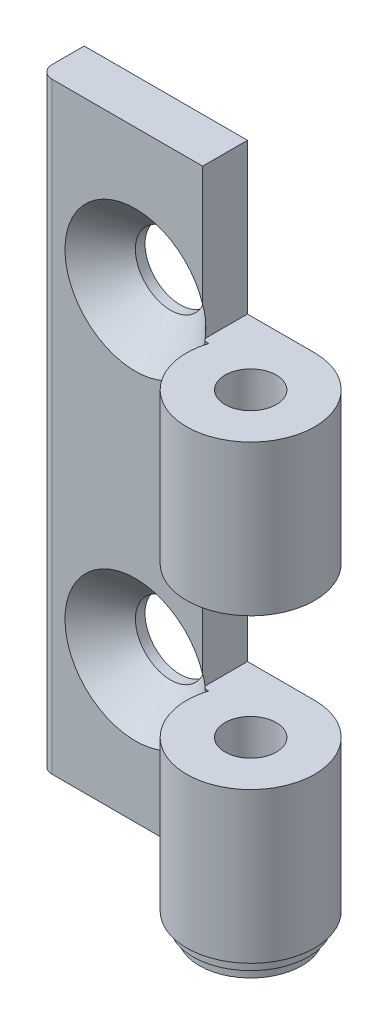
ISO-10303-21;
HEADER;
FILE_DESCRIPTION(('STEP AP214'),'2;1');
FILE_NAME('part.step','',(''),(''),'','','');
FILE_SCHEMA(('AUTOMOTIVE_DESIGN { 1 0 10303 214 1 1 1 1 }'));
ENDSEC;
DATA;
#1=APPLICATION_CONTEXT('core data for automotive mechanical design processes');
#2=APPLICATION_PROTOCOL_DEFINITION('international standard','automotive_design',2000,#1);
#3=PRODUCT_CONTEXT('',#1,'mechanical');
#4=PRODUCT('Part','Part','',(#3));
#5=PRODUCT_RELATED_PRODUCT_CATEGORY('part','',(#4));
#6=PRODUCT_DEFINITION_FORMATION('','',#4);
#7=PRODUCT_DEFINITION_CONTEXT('part definition',#1,'design');
#8=PRODUCT_DEFINITION('design','',#6,#7);
#9=PRODUCT_DEFINITION_SHAPE('','',#8);
#10=(LENGTH_UNIT() NAMED_UNIT(*) SI_UNIT(.MILLI.,.METRE.));
#11=(NAMED_UNIT(*) PLANE_ANGLE_UNIT() SI_UNIT($,.RADIAN.));
#12=(NAMED_UNIT(*) SI_UNIT($,.STERADIAN.) SOLID_ANGLE_UNIT());
#13=UNCERTAINTY_MEASURE_WITH_UNIT(LENGTH_MEASURE(1.E-05),#10,'distance_accuracy_value','');
#14=(GEOMETRIC_REPRESENTATION_CONTEXT(3) GLOBAL_UNCERTAINTY_ASSIGNED_CONTEXT((#13)) GLOBAL_UNIT_ASSIGNED_CONTEXT((#10,
#11,#12)) REPRESENTATION_CONTEXT('',''));
#15=CARTESIAN_POINT('',(0.,0.,0.));
#16=DIRECTION('',(0.,0.,1.));
#17=DIRECTION('',(1.,0.,0.));
#18=AXIS2_PLACEMENT_3D('',#15,#16,#17);
#19=CARTESIAN_POINT('',(0.,0.,-1.5));
#20=DIRECTION('',(0.,0.,1.));
#21=DIRECTION('',(1.,0.,0.));
#22=AXIS2_PLACEMENT_3D('',#19,#20,#21);
#23=PLANE('',#22);
#24=DIRECTION('',(-1.,0.,0.));
#25=VECTOR('',#24,1.);
#26=CARTESIAN_POINT('',(0.,23.5,-1.5));
#27=LINE('',#26,#25);
#28=CARTESIAN_POINT('',(-5.25,23.5,-1.5));
#29=VERTEX_POINT('',#28);
#30=CARTESIAN_POINT('',(-17.,23.5,-1.5));
#31=VERTEX_POINT('',#30);
#32=EDGE_CURVE('E156',#29,#31,#27,.T.);
#33=ORIENTED_EDGE('',*,*,#32,.T.);
#34=DIRECTION('',(0.,-1.,0.));
#35=VECTOR('',#34,1.);
#36=CARTESIAN_POINT('',(-17.,23.5,-1.5));
#37=LINE('',#36,#35);
#38=CARTESIAN_POINT('',(-17.,-23.5,-1.5));
#39=VERTEX_POINT('',#38);
#40=EDGE_CURVE('E137',#31,#39,#37,.T.);
#41=ORIENTED_EDGE('',*,*,#40,.T.);
#42=DIRECTION('',(1.,0.,0.));
#43=VECTOR('',#42,1.);
#44=CARTESIAN_POINT('',(-18.,-23.5,-1.5));
#45=LINE('',#44,#43);
#46=CARTESIAN_POINT('',(-4.76969600708473,-23.5,-1.5));
#47=VERTEX_POINT('',#46);
#48=EDGE_CURVE('E146',#39,#47,#45,.T.);
#49=ORIENTED_EDGE('',*,*,#48,.T.);
#50=DIRECTION('',(0.,1.,0.));
#51=VECTOR('',#50,1.);
#52=CARTESIAN_POINT('',(-4.76969600708473,-23.5,-1.5));
#53=LINE('',#52,#51);
#54=CARTESIAN_POINT('',(-4.76969600708473,-11.75,-1.5));
#55=VERTEX_POINT('',#54);
#56=EDGE_CURVE('E154',#55,#47,#53,.F.);
#57=ORIENTED_EDGE('',*,*,#56,.F.);
#58=DIRECTION('',(1.,0.,0.));
#59=VECTOR('',#58,1.);
#60=CARTESIAN_POINT('',(0.,-11.75,-1.5));
#61=LINE('',#60,#59);
#62=CARTESIAN_POINT('',(-5.05137632057416,-11.75,-1.5));
#63=VERTEX_POINT('',#62);
#64=EDGE_CURVE('E277',#63,#55,#61,.T.);
#65=ORIENTED_EDGE('',*,*,#64,.F.);
#66=CARTESIAN_POINT('',(-10.5,-12.5,-1.5));
#67=DIRECTION('',(0.,0.,-1.));
#68=DIRECTION('',(-1.,0.,0.));
#69=AXIS2_PLACEMENT_3D('',#66,#67,#68);
#70=CIRCLE('',#69,5.5);
#71=CARTESIAN_POINT('',(-5.25,-10.8606403689245,-1.5));
#72=VERTEX_POINT('',#71);
#73=EDGE_CURVE('E298',#63,#72,#70,.T.);
#74=ORIENTED_EDGE('',*,*,#73,.T.);
#75=DIRECTION('',(0.,-1.,0.));
#76=VECTOR('',#75,1.);
#77=CARTESIAN_POINT('',(-5.25,0.,-1.5));
#78=LINE('',#77,#76);
#79=CARTESIAN_POINT('',(-5.25,0.,-1.5));
#80=VERTEX_POINT('',#79);
#81=EDGE_CURVE('E266',#80,#72,#78,.T.);
#82=ORIENTED_EDGE('',*,*,#81,.F.);
#83=DIRECTION('',(-1.,0.,0.));
#84=VECTOR('',#83,1.);
#85=CARTESIAN_POINT('',(0.,0.,-1.5));
#86=LINE('',#85,#84);
#87=CARTESIAN_POINT('',(-4.76969600708473,0.,-1.5));
#88=VERTEX_POINT('',#87);
#89=EDGE_CURVE('E263',#88,#80,#86,.T.);
#90=ORIENTED_EDGE('',*,*,#89,.F.);
#91=CARTESIAN_POINT('',(-4.76969600708473,11.75,-1.5));
#92=VERTEX_POINT('',#91);
#93=EDGE_CURVE('E164',#92,#88,#53,.F.);
#94=ORIENTED_EDGE('',*,*,#93,.F.);
#95=DIRECTION('',(1.,0.,0.));
#96=VECTOR('',#95,1.);
#97=CARTESIAN_POINT('',(0.,11.75,-1.5));
#98=LINE('',#97,#96);
#99=CARTESIAN_POINT('',(-5.05137632057416,11.75,-1.5));
#100=VERTEX_POINT('',#99);
#101=EDGE_CURVE('E261',#100,#92,#98,.T.);
#102=ORIENTED_EDGE('',*,*,#101,.F.);
#103=CARTESIAN_POINT('',(-10.5,12.5,-1.5));
#104=DIRECTION('',(0.,0.,-1.));
#105=DIRECTION('',(-1.,0.,0.));
#106=AXIS2_PLACEMENT_3D('',#103,#104,#105);
#107=CIRCLE('',#106,5.5);
#108=CARTESIAN_POINT('',(-5.25,14.1393596310755,-1.5));
#109=VERTEX_POINT('',#108);
#110=EDGE_CURVE('E136',#100,#109,#107,.T.);
#111=ORIENTED_EDGE('',*,*,#110,.T.);
#112=DIRECTION('',(0.,-1.,0.));
#113=VECTOR('',#112,1.);
#114=CARTESIAN_POINT('',(-5.25,0.,-1.5));
#115=LINE('',#114,#113);
#116=EDGE_CURVE('E508',#29,#109,#115,.T.);
#117=ORIENTED_EDGE('',*,*,#116,.F.);
#118=EDGE_LOOP('',(#33,#41,#49,#57,#65,#74,#82,#90,#94,#102,#111,#117));
#119=FACE_BOUND('',#118,.T.);
#120=ADVANCED_FACE('F32',(#119),#23,.T.);
#121=CARTESIAN_POINT('',(5.,-23.5,0.));
#122=DIRECTION('',(0.,1.,0.));
#123=DIRECTION('',(0.,0.,1.));
#124=AXIS2_PLACEMENT_3D('',#121,#122,#123);
#125=PLANE('',#124);
#126=CARTESIAN_POINT('',(0.,-23.5,0.));
#127=DIRECTION('',(0.,1.,0.));
#128=DIRECTION('',(0.,0.,1.));
#129=AXIS2_PLACEMENT_3D('',#126,#127,#128);
#130=CIRCLE('',#129,4.5);
#131=CARTESIAN_POINT('',(0.,-23.5,4.5));
#132=VERTEX_POINT('',#131);
#133=EDGE_CURVE('E182',#132,#132,#130,.F.);
#134=ORIENTED_EDGE('',*,*,#133,.F.);
#135=EDGE_LOOP('',(#134));
#136=FACE_BOUND('',#135,.T.);
#137=CARTESIAN_POINT('',(-17.0000000000007,-23.5,-2.49999999999931));
#138=DIRECTION('',(0.,-1.,0.));
#139=DIRECTION('',(0.,0.,-1.));
#140=AXIS2_PLACEMENT_3D('',#137,#138,#139);
#141=CIRCLE('',#140,0.999999999999304);
#142=CARTESIAN_POINT('',(-18.,-23.5,-2.5));
#143=VERTEX_POINT('',#142);
#144=EDGE_CURVE('E131',#39,#143,#141,.T.);
#145=ORIENTED_EDGE('',*,*,#144,.T.);
#146=DIRECTION('',(0.,0.,-1.));
#147=VECTOR('',#146,1.);
#148=CARTESIAN_POINT('',(-18.,-23.5,-1.5));
#149=LINE('',#148,#147);
#150=CARTESIAN_POINT('',(-18.,-23.5,-5.));
#151=VERTEX_POINT('',#150);
#152=EDGE_CURVE('E143',#143,#151,#149,.T.);
#153=ORIENTED_EDGE('',*,*,#152,.T.);
#154=DIRECTION('',(1.,0.,0.));
#155=VECTOR('',#154,1.);
#156=CARTESIAN_POINT('',(-18.,-23.5,-5.));
#157=LINE('',#156,#155);
#158=CARTESIAN_POINT('',(0.,-23.5,-5.));
#159=VERTEX_POINT('',#158);
#160=EDGE_CURVE('E283',#151,#159,#157,.T.);
#161=ORIENTED_EDGE('',*,*,#160,.T.);
#162=CARTESIAN_POINT('',(0.,-23.5,0.));
#163=DIRECTION('',(0.,1.,0.));
#164=DIRECTION('',(0.,0.,1.));
#165=AXIS2_PLACEMENT_3D('',#162,#163,#164);
#166=CIRCLE('',#165,5.);
#167=EDGE_CURVE('E165',#47,#159,#166,.T.);
#168=ORIENTED_EDGE('',*,*,#167,.F.);
#169=ORIENTED_EDGE('',*,*,#48,.F.);
#170=EDGE_LOOP('',(#145,#153,#161,#168,#169));
#171=FACE_BOUND('',#170,.T.);
#172=ADVANCED_FACE('F141',(#136,#171),#125,.F.);
#173=CARTESIAN_POINT('',(0.,23.5,0.));
#174=DIRECTION('',(0.,-1.,0.));
#175=DIRECTION('',(0.,0.,-1.));
#176=AXIS2_PLACEMENT_3D('',#173,#174,#175);
#177=PLANE('',#176);
#178=CARTESIAN_POINT('',(-17.0000000000007,23.5,-2.49999999999931));
#179=DIRECTION('',(0.,-1.,0.));
#180=DIRECTION('',(0.,0.,-1.));
#181=AXIS2_PLACEMENT_3D('',#178,#179,#180);
#182=CIRCLE('',#181,0.999999999999304);
#183=CARTESIAN_POINT('',(-18.,23.5,-2.5));
#184=VERTEX_POINT('',#183);
#185=EDGE_CURVE('E52',#31,#184,#182,.T.);
#186=ORIENTED_EDGE('',*,*,#185,.F.);
#187=ORIENTED_EDGE('',*,*,#32,.F.);
#188=DIRECTION('',(0.,0.,-1.));
#189=VECTOR('',#188,1.);
#190=CARTESIAN_POINT('',(-5.25,23.5,47.));
#191=LINE('',#190,#189);
#192=CARTESIAN_POINT('',(-5.25,23.5,-5.));
#193=VERTEX_POINT('',#192);
#194=EDGE_CURVE('E500',#29,#193,#191,.T.);
#195=ORIENTED_EDGE('',*,*,#194,.T.);
#196=DIRECTION('',(-1.,0.,0.));
#197=VECTOR('',#196,1.);
#198=CARTESIAN_POINT('',(0.,23.5,-5.));
#199=LINE('',#198,#197);
#200=CARTESIAN_POINT('',(-18.,23.5,-5.));
#201=VERTEX_POINT('',#200);
#202=EDGE_CURVE('E279',#193,#201,#199,.T.);
#203=ORIENTED_EDGE('',*,*,#202,.T.);
#204=DIRECTION('',(0.,0.,-1.));
#205=VECTOR('',#204,1.);
#206=CARTESIAN_POINT('',(-18.,23.5,-1.5));
#207=LINE('',#206,#205);
#208=EDGE_CURVE('E152',#184,#201,#207,.T.);
#209=ORIENTED_EDGE('',*,*,#208,.F.);
#210=EDGE_LOOP('',(#186,#187,#195,#203,#209));
#211=FACE_BOUND('',#210,.T.);
#212=ADVANCED_FACE('F34',(#211),#177,.F.);
#213=CARTESIAN_POINT('',(-18.,23.5,-1.5));
#214=DIRECTION('',(1.,0.,0.));
#215=DIRECTION('',(0.,0.,-1.));
#216=AXIS2_PLACEMENT_3D('',#213,#214,#215);
#217=PLANE('',#216);
#218=DIRECTION('',(0.,-1.,0.));
#219=VECTOR('',#218,1.);
#220=CARTESIAN_POINT('',(-18.,23.5,-2.5));
#221=LINE('',#220,#219);
#222=EDGE_CURVE('E128',#184,#143,#221,.T.);
#223=ORIENTED_EDGE('',*,*,#222,.F.);
#224=ORIENTED_EDGE('',*,*,#208,.T.);
#225=DIRECTION('',(0.,-1.,0.));
#226=VECTOR('',#225,1.);
#227=CARTESIAN_POINT('',(-18.,23.5,-5.));
#228=LINE('',#227,#226);
#229=EDGE_CURVE('E150',#201,#151,#228,.T.);
#230=ORIENTED_EDGE('',*,*,#229,.T.);
#231=ORIENTED_EDGE('',*,*,#152,.F.);
#232=EDGE_LOOP('',(#223,#224,#230,#231));
#233=FACE_BOUND('',#232,.T.);
#234=ADVANCED_FACE('F148',(#233),#217,.F.);
#235=CARTESIAN_POINT('',(0.,0.,-5.));
#236=DIRECTION('',(0.,0.,1.));
#237=DIRECTION('',(1.,0.,0.));
#238=AXIS2_PLACEMENT_3D('',#235,#236,#237);
#239=PLANE('',#238);
#240=CARTESIAN_POINT('',(-10.5,-12.5,-5.));
#241=DIRECTION('',(0.,0.,-1.));
#242=DIRECTION('',(-1.,0.,0.));
#243=AXIS2_PLACEMENT_3D('',#240,#241,#242);
#244=CIRCLE('',#243,2.75);
#245=CARTESIAN_POINT('',(-13.25,-12.5,-5.));
#246=VERTEX_POINT('',#245);
#247=EDGE_CURVE('E215',#246,#246,#244,.T.);
#248=ORIENTED_EDGE('',*,*,#247,.F.);
#249=EDGE_LOOP('',(#248));
#250=FACE_BOUND('',#249,.T.);
#251=DIRECTION('',(0.,-1.,0.));
#252=VECTOR('',#251,1.);
#253=CARTESIAN_POINT('',(-5.25,0.,-5.));
#254=LINE('',#253,#252);
#255=CARTESIAN_POINT('',(-5.25,0.,-5.));
#256=VERTEX_POINT('',#255);
#257=CARTESIAN_POINT('',(-5.25,-11.75,-5.));
#258=VERTEX_POINT('',#257);
#259=EDGE_CURVE('E176',#256,#258,#254,.T.);
#260=ORIENTED_EDGE('',*,*,#259,.T.);
#261=DIRECTION('',(1.,0.,0.));
#262=VECTOR('',#261,1.);
#263=CARTESIAN_POINT('',(0.,-11.75,-5.));
#264=LINE('',#263,#262);
#265=CARTESIAN_POINT('',(0.,-11.75,-5.));
#266=VERTEX_POINT('',#265);
#267=EDGE_CURVE('E179',#258,#266,#264,.T.);
#268=ORIENTED_EDGE('',*,*,#267,.T.);
#269=DIRECTION('',(0.,1.,0.));
#270=VECTOR('',#269,1.);
#271=CARTESIAN_POINT('',(0.,-23.5,-5.));
#272=LINE('',#271,#270);
#273=EDGE_CURVE('E159',#159,#266,#272,.T.);
#274=ORIENTED_EDGE('',*,*,#273,.F.);
#275=ORIENTED_EDGE('',*,*,#160,.F.);
#276=ORIENTED_EDGE('',*,*,#229,.F.);
#277=ORIENTED_EDGE('',*,*,#202,.F.);
#278=DIRECTION('',(0.,-1.,0.));
#279=VECTOR('',#278,1.);
#280=CARTESIAN_POINT('',(-5.25,0.,-5.));
#281=LINE('',#280,#279);
#282=CARTESIAN_POINT('',(-5.25,11.75,-5.));
#283=VERTEX_POINT('',#282);
#284=EDGE_CURVE('E167',#193,#283,#281,.T.);
#285=ORIENTED_EDGE('',*,*,#284,.T.);
#286=DIRECTION('',(1.,0.,0.));
#287=VECTOR('',#286,1.);
#288=CARTESIAN_POINT('',(0.,11.75,-5.));
#289=LINE('',#288,#287);
#290=CARTESIAN_POINT('',(0.,11.75,-5.));
#291=VERTEX_POINT('',#290);
#292=EDGE_CURVE('E170',#283,#291,#289,.T.);
#293=ORIENTED_EDGE('',*,*,#292,.T.);
#294=CARTESIAN_POINT('',(0.,0.,-5.));
#295=VERTEX_POINT('',#294);
#296=EDGE_CURVE('E284',#295,#291,#272,.T.);
#297=ORIENTED_EDGE('',*,*,#296,.F.);
#298=DIRECTION('',(-1.,0.,0.));
#299=VECTOR('',#298,1.);
#300=CARTESIAN_POINT('',(0.,0.,-5.));
#301=LINE('',#300,#299);
#302=EDGE_CURVE('E173',#295,#256,#301,.T.);
#303=ORIENTED_EDGE('',*,*,#302,.T.);
#304=EDGE_LOOP('',(#260,#268,#274,#275,#276,#277,#285,#293,#297,#303));
#305=FACE_BOUND('',#304,.T.);
#306=CARTESIAN_POINT('',(-10.5,12.5,-5.));
#307=DIRECTION('',(0.,0.,-1.));
#308=DIRECTION('',(-1.,0.,0.));
#309=AXIS2_PLACEMENT_3D('',#306,#307,#308);
#310=CIRCLE('',#309,2.75);
#311=CARTESIAN_POINT('',(-13.25,12.5,-5.));
#312=VERTEX_POINT('',#311);
#313=EDGE_CURVE('E308',#312,#312,#310,.T.);
#314=ORIENTED_EDGE('',*,*,#313,.F.);
#315=EDGE_LOOP('',(#314));
#316=FACE_BOUND('',#315,.T.);
#317=ADVANCED_FACE('F227',(#250,#305,#316),#239,.F.);
#318=CARTESIAN_POINT('',(5.,11.75,47.));
#319=DIRECTION('',(0.,-1.,0.));
#320=DIRECTION('',(0.,0.,-1.));
#321=AXIS2_PLACEMENT_3D('',#318,#319,#320);
#322=PLANE('',#321);
#323=CARTESIAN_POINT('',(0.,11.75,0.));
#324=DIRECTION('',(0.,-1.,0.));
#325=DIRECTION('',(0.,0.,-1.));
#326=AXIS2_PLACEMENT_3D('',#323,#324,#325);
#327=CIRCLE('',#326,2.);
#328=CARTESIAN_POINT('',(0.,11.75,-2.));
#329=VERTEX_POINT('',#328);
#330=EDGE_CURVE('E524',#329,#329,#327,.F.);
#331=ORIENTED_EDGE('',*,*,#330,.F.);
#332=EDGE_LOOP('',(#331));
#333=FACE_BOUND('',#332,.T.);
#334=CARTESIAN_POINT('',(-1.70955543510102,11.75,1.82238151796679));
#335=CARTESIAN_POINT('',(-2.00511336183713,11.75,1.52790121895714));
#336=CARTESIAN_POINT('',(-2.30071768698271,11.75,1.23346743947847));
#337=CARTESIAN_POINT('',(-2.89207297914804,11.75,0.644752452085937));
#338=CARTESIAN_POINT('',(-3.18782394483944,11.75,0.350471242837695));
#339=CARTESIAN_POINT('',(-3.77951995065819,11.75,-0.237872710070981));
#340=CARTESIAN_POINT('',(-4.07546498266957,11.75,-0.531935461891403));
#341=CARTESIAN_POINT('',(-4.66766681123759,11.75,-1.11975217486902));
#342=CARTESIAN_POINT('',(-4.96392361054433,11.75,-1.41350613325588));
#343=CARTESIAN_POINT('',(-5.55694165396295,11.75,-2.00054729595557));
#344=CARTESIAN_POINT('',(-5.85370293259675,11.75,-2.29383446542827));
#345=CARTESIAN_POINT('',(-6.29947573631412,11.75,-2.73311813377528));
#346=CARTESIAN_POINT('',(-6.44817005727574,11.75,-2.87943644997767));
#347=CARTESIAN_POINT('',(-6.74585437400217,11.75,-3.17177404599918));
#348=CARTESIAN_POINT('',(-6.8948443716213,11.75,-3.31779332393114));
#349=CARTESIAN_POINT('',(-7.19325465389007,11.75,-3.60941549569947));
#350=CARTESIAN_POINT('',(-7.34267497183976,11.75,-3.7550183554738));
#351=CARTESIAN_POINT('',(-7.64213307689578,11.75,-4.04558375387482));
#352=CARTESIAN_POINT('',(-7.79217085323555,11.75,-4.19054630357592));
#353=CARTESIAN_POINT('',(-8.01797725377844,11.75,-4.40722261171559));
#354=CARTESIAN_POINT('',(-8.09337438122519,11.75,-4.47932331919674));
#355=CARTESIAN_POINT('',(-8.24449480832945,11.75,-4.62318102552218));
#356=CARTESIAN_POINT('',(-8.32021810535555,11.75,-4.69493802712951));
#357=CARTESIAN_POINT('',(-8.47209696485743,11.75,-4.83800338057768));
#358=CARTESIAN_POINT('',(-8.54825255311584,11.75,-4.90931170511226));
#359=CARTESIAN_POINT('',(-8.70117025803067,11.75,-5.05127877751312));
#360=CARTESIAN_POINT('',(-8.77793239159957,11.75,-5.12193750714687));
#361=CARTESIAN_POINT('',(-8.85508506873584,11.75,-5.19217115547523));
#362=B_SPLINE_CURVE_WITH_KNOTS('',3,(#334,#335,#336,#337,#338,#339,#340,#341,#342,#343,#344,
#345,#346,#347,#348,#349,#350,#351,#352,#353,#354,#355,#356,#357,#358,#359,#360,#361),
.UNSPECIFIED.,.F.,.F.,(4,2,2,2,2,2,2,2,2,2,2,2,2,4),(0.,1.25166222359041,2.50331330891406,
3.75491501973666,5.0065278650751,6.25823011578679,6.8840664470222,7.50990671563645,
8.13579679069347,8.76167599801296,9.07464345208767,9.38760838597535,9.70059218600535,
10.0135847440666),.UNSPECIFIED.);
#363=CARTESIAN_POINT('',(-5.25,11.75,-1.69669914110089));
#364=VERTEX_POINT('',#363);
#365=EDGE_CURVE('E59',#100,#364,#362,.T.);
#366=ORIENTED_EDGE('',*,*,#365,.F.);
#367=ORIENTED_EDGE('',*,*,#101,.T.);
#368=CARTESIAN_POINT('',(0.,11.75,0.));
#369=DIRECTION('',(0.,-1.,0.));
#370=DIRECTION('',(0.,0.,-1.));
#371=AXIS2_PLACEMENT_3D('',#368,#369,#370);
#372=CIRCLE('',#371,5.);
#373=EDGE_CURVE('E256',#291,#92,#372,.T.);
#374=ORIENTED_EDGE('',*,*,#373,.F.);
#375=ORIENTED_EDGE('',*,*,#292,.F.);
#376=DIRECTION('',(0.,0.,-1.));
#377=VECTOR('',#376,1.);
#378=CARTESIAN_POINT('',(-5.25,11.75,47.));
#379=LINE('',#378,#377);
#380=EDGE_CURVE('E504',#364,#283,#379,.T.);
#381=ORIENTED_EDGE('',*,*,#380,.F.);
#382=EDGE_LOOP('',(#366,#367,#374,#375,#381));
#383=FACE_BOUND('',#382,.T.);
#384=ADVANCED_FACE('F230',(#333,#383),#322,.F.);
#385=CARTESIAN_POINT('',(-5.25,11.75,47.));
#386=DIRECTION('',(-1.,0.,0.));
#387=DIRECTION('',(0.,0.,1.));
#388=AXIS2_PLACEMENT_3D('',#385,#386,#387);
#389=PLANE('',#388);
#390=CARTESIAN_POINT('',(-5.25,7.05985414039446,0.560270297666831));
#391=CARTESIAN_POINT('',(-5.25,7.20778178172047,0.453858684881752));
#392=CARTESIAN_POINT('',(-5.25,7.3566851065789,0.348775331604515));
#393=CARTESIAN_POINT('',(-5.25,7.65684519982505,0.141896730009044));
#394=CARTESIAN_POINT('',(-5.25,7.80810290610333,0.0401028444683483));
#395=CARTESIAN_POINT('',(-5.25,8.11507304593084,-0.160667207621523));
#396=CARTESIAN_POINT('',(-5.25,8.27081709366277,-0.25959528942593));
#397=CARTESIAN_POINT('',(-5.25,8.58538958610237,-0.452388694611419));
#398=CARTESIAN_POINT('',(-5.25,8.74421768611816,-0.546254579394153));
#399=CARTESIAN_POINT('',(-5.25,9.07147275814435,-0.73115607121939));
#400=CARTESIAN_POINT('',(-5.25,9.24003629166466,-0.821953355673844));
#401=CARTESIAN_POINT('',(-5.25,9.58142883818698,-0.995095724147129));
#402=CARTESIAN_POINT('',(-5.25,9.75425874853573,-1.07743901092095));
#403=CARTESIAN_POINT('',(-5.25,10.2782240067665,-1.30782313033576));
#404=CARTESIAN_POINT('',(-5.25,10.6367928724864,-1.44037915045053));
#405=CARTESIAN_POINT('',(-5.25,11.1285573016708,-1.57515100832944));
#406=CARTESIAN_POINT('',(-5.25,11.2541704853184,-1.6056254318098));
#407=CARTESIAN_POINT('',(-5.25,11.5071761161818,-1.65838048103734));
#408=CARTESIAN_POINT('',(-5.25,11.6345690856586,-1.68065864692827));
#409=CARTESIAN_POINT('',(-5.25,11.8894417217531,-1.71610870227699));
#410=CARTESIAN_POINT('',(-5.25,12.0169100179466,-1.72936172991462));
#411=CARTESIAN_POINT('',(-5.25,12.2724721456118,-1.74661918470615));
#412=CARTESIAN_POINT('',(-5.25,12.4005659733147,-1.75062366751108));
#413=CARTESIAN_POINT('',(-5.25,12.6887061187775,-1.7490447941776));
#414=CARTESIAN_POINT('',(-5.25,12.8487443547678,-1.74081769040819));
#415=CARTESIAN_POINT('',(-5.25,13.1674499366833,-1.71012307075787));
#416=CARTESIAN_POINT('',(-5.25,13.3261169933269,-1.68765262084131));
#417=CARTESIAN_POINT('',(-5.25,13.6418049983457,-1.6295239596873));
#418=CARTESIAN_POINT('',(-5.25,13.7988137378231,-1.59380032457733));
#419=CARTESIAN_POINT('',(-5.25,14.1097131953771,-1.51080941545277));
#420=CARTESIAN_POINT('',(-5.25,14.2636038039745,-1.46354173687856));
#421=CARTESIAN_POINT('',(-5.25,14.5834411782327,-1.353903016485));
#422=CARTESIAN_POINT('',(-5.25,14.7490262917152,-1.29048596609152));
#423=CARTESIAN_POINT('',(-5.25,15.0761354779487,-1.15390128102785));
#424=CARTESIAN_POINT('',(-5.25,15.2376583406277,-1.08073078093153));
#425=CARTESIAN_POINT('',(-5.25,15.5571298264393,-0.926372578022001));
#426=CARTESIAN_POINT('',(-5.25,15.7150720413799,-0.845171711822329));
#427=CARTESIAN_POINT('',(-5.25,16.0274568403983,-0.676379036766601));
#428=CARTESIAN_POINT('',(-5.25,16.1818998481521,-0.588788007095044));
#429=CARTESIAN_POINT('',(-5.25,16.4897425674828,-0.407208966887783));
#430=CARTESIAN_POINT('',(-5.25,16.6431010074531,-0.313151310256872));
#431=CARTESIAN_POINT('',(-5.25,16.9470565928445,-0.120684618911394));
#432=CARTESIAN_POINT('',(-5.25,17.0976536747275,-0.0222754842479706));
#433=CARTESIAN_POINT('',(-5.25,17.3962982238091,0.178020700916425));
#434=CARTESIAN_POINT('',(-5.25,17.5443480221055,0.279904285784767));
#435=CARTESIAN_POINT('',(-5.25,17.8383563265677,0.486630500276117));
#436=CARTESIAN_POINT('',(-5.25,17.9843148788938,0.591473064433157));
#437=CARTESIAN_POINT('',(-5.25,18.3704243024526,0.873835186058243));
#438=CARTESIAN_POINT('',(-5.25,18.6089825294956,1.05353197226316));
#439=CARTESIAN_POINT('',(-5.25,19.0821295295218,1.41808984517066));
#440=CARTESIAN_POINT('',(-5.25,19.3167179706882,1.60295136017976));
#441=CARTESIAN_POINT('',(-5.25,19.7827449638652,1.97672028195951));
#442=CARTESIAN_POINT('',(-5.25,20.0141826618453,2.16562875132863));
#443=CARTESIAN_POINT('',(-5.25,20.4744475397787,2.54660429345085));
#444=CARTESIAN_POINT('',(-5.25,20.7032746538523,2.73867144561782));
#445=CARTESIAN_POINT('',(-5.25,21.159144909611,3.12564816259686));
#446=CARTESIAN_POINT('',(-5.25,21.3861845796562,3.32056181139312));
#447=CARTESIAN_POINT('',(-5.25,21.8384701994132,3.71246083911253));
#448=CARTESIAN_POINT('',(-5.25,22.0637161313818,3.90944623848418));
#449=CARTESIAN_POINT('',(-5.25,22.7371352079884,4.50287702660287));
#450=CARTESIAN_POINT('',(-5.25,23.1830682544841,4.90186420622877));
#451=CARTESIAN_POINT('',(-5.25,24.0323605400424,5.66996868330723));
#452=CARTESIAN_POINT('',(-5.25,24.4360749602836,6.03869475057811));
#453=CARTESIAN_POINT('',(-5.25,25.2407733527543,6.77915084999988));
#454=CARTESIAN_POINT('',(-5.25,25.6417571942285,7.15088102416592));
#455=CARTESIAN_POINT('',(-5.25,26.4403024335503,7.89542603529059));
#456=CARTESIAN_POINT('',(-5.25,26.837870695247,8.26823352065776));
#457=CARTESIAN_POINT('',(-5.25,27.6312731569108,9.01563515473865));
#458=CARTESIAN_POINT('',(-5.25,28.0271074745654,9.39022917847407));
#459=CARTESIAN_POINT('',(-5.25,28.4222953823483,9.76549999978381));
#460=B_SPLINE_CURVE_WITH_KNOTS('',3,(#390,#391,#392,#393,#394,#395,#396,#397,#398,#399,#400,
#401,#402,#403,#404,#405,#406,#407,#408,#409,#410,#411,#412,#413,#414,#415,#416,#417,#418,#419,
#420,#421,#422,#423,#424,#425,#426,#427,#428,#429,#430,#431,#432,#433,#434,#435,#436,#437,#438,
#439,#440,#441,#442,#443,#444,#445,#446,#447,#448,#449,#450,#451,#452,#453,#454,#455,#456,#457,
#458,#459),.UNSPECIFIED.,.F.,.F.,(4,2,2,2,2,2,2,2,2,2,2,2,2,2,2,2,2,2,2,2,2,2,2,2,2,2,2,2,2,2,2,
2,2,2,4),(0.,0.546692133050946,1.09360792218837,1.64704649353916,2.20042356136479,
2.77456282286882,3.34882388964802,4.49054415864057,4.87810254183568,5.26577714413565,
5.64991874246711,6.03405802930711,6.51411637837543,6.99427364845798,7.47683343940031,
7.95941014401977,8.49096668856913,9.02267974254929,9.555279301885,10.087814026896,
10.627439352294,11.1670770787609,11.7061914358968,12.2452938747273,13.1411868593005,
14.0371543613421,14.9333600707514,15.8295883466241,16.7272617899445,17.6249441017715,
19.4199984796423,21.0602562881778,22.7005920966735,24.3356437936907,25.9705827401036),.UNSPECIFIED.);
#461=EDGE_CURVE('E11',#364,#109,#460,.T.);
#462=ORIENTED_EDGE('',*,*,#461,.F.);
#463=ORIENTED_EDGE('',*,*,#380,.T.);
#464=ORIENTED_EDGE('',*,*,#284,.F.);
#465=ORIENTED_EDGE('',*,*,#194,.F.);
#466=ORIENTED_EDGE('',*,*,#116,.T.);
#467=EDGE_LOOP('',(#462,#463,#464,#465,#466));
#468=FACE_BOUND('',#467,.T.);
#469=ADVANCED_FACE('F222',(#468),#389,.F.);
#470=CARTESIAN_POINT('',(5.,-11.75,47.));
#471=DIRECTION('',(0.,-1.,0.));
#472=DIRECTION('',(0.,0.,-1.));
#473=AXIS2_PLACEMENT_3D('',#470,#471,#472);
#474=PLANE('',#473);
#475=CARTESIAN_POINT('',(0.,-11.75,0.));
#476=DIRECTION('',(0.,-1.,0.));
#477=DIRECTION('',(0.,0.,-1.));
#478=AXIS2_PLACEMENT_3D('',#475,#476,#477);
#479=CIRCLE('',#478,2.);
#480=CARTESIAN_POINT('',(0.,-11.75,-2.));
#481=VERTEX_POINT('',#480);
#482=EDGE_CURVE('E526',#481,#481,#479,.F.);
#483=ORIENTED_EDGE('',*,*,#482,.F.);
#484=EDGE_LOOP('',(#483));
#485=FACE_BOUND('',#484,.T.);
#486=CARTESIAN_POINT('',(-1.70955543510103,-11.75,1.82238151796679));
#487=CARTESIAN_POINT('',(-2.00511336183713,-11.75,1.52790121895714));
#488=CARTESIAN_POINT('',(-2.30071768698271,-11.75,1.23346743947847));
#489=CARTESIAN_POINT('',(-2.89207297914804,-11.75,0.644752452085939));
#490=CARTESIAN_POINT('',(-3.18782394483944,-11.75,0.350471242837697));
#491=CARTESIAN_POINT('',(-3.77951995065819,-11.75,-0.237872710070979));
#492=CARTESIAN_POINT('',(-4.07546498266957,-11.75,-0.531935461891402));
#493=CARTESIAN_POINT('',(-4.66766681123759,-11.75,-1.11975217486902));
#494=CARTESIAN_POINT('',(-4.96392361054433,-11.75,-1.41350613325587));
#495=CARTESIAN_POINT('',(-5.55694165396296,-11.75,-2.00054729595557));
#496=CARTESIAN_POINT('',(-5.85370293259675,-11.75,-2.29383446542827));
#497=CARTESIAN_POINT('',(-6.29947573631412,-11.75,-2.73311813377527));
#498=CARTESIAN_POINT('',(-6.44817005727574,-11.75,-2.87943644997767));
#499=CARTESIAN_POINT('',(-6.74585437400217,-11.75,-3.17177404599917));
#500=CARTESIAN_POINT('',(-6.8948443716213,-11.75,-3.31779332393114));
#501=CARTESIAN_POINT('',(-7.19325465389007,-11.75,-3.60941549569947));
#502=CARTESIAN_POINT('',(-7.34267497183976,-11.75,-3.7550183554738));
#503=CARTESIAN_POINT('',(-7.64213307689578,-11.75,-4.04558375387482));
#504=CARTESIAN_POINT('',(-7.79217085323555,-11.75,-4.19054630357592));
#505=CARTESIAN_POINT('',(-8.01797725377845,-11.75,-4.40722261171559));
#506=CARTESIAN_POINT('',(-8.09337438122519,-11.75,-4.47932331919674));
#507=CARTESIAN_POINT('',(-8.24449480832945,-11.75,-4.62318102552218));
#508=CARTESIAN_POINT('',(-8.32021810535555,-11.75,-4.69493802712951));
#509=CARTESIAN_POINT('',(-8.47209696485743,-11.75,-4.83800338057768));
#510=CARTESIAN_POINT('',(-8.54825255311584,-11.75,-4.90931170511226));
#511=CARTESIAN_POINT('',(-8.70117025803067,-11.75,-5.05127877751312));
#512=CARTESIAN_POINT('',(-8.77793239159957,-11.75,-5.12193750714687));
#513=CARTESIAN_POINT('',(-8.85508506873584,-11.75,-5.19217115547523));
#514=B_SPLINE_CURVE_WITH_KNOTS('',3,(#486,#487,#488,#489,#490,#491,#492,#493,#494,#495,#496,
#497,#498,#499,#500,#501,#502,#503,#504,#505,#506,#507,#508,#509,#510,#511,#512,#513),
.UNSPECIFIED.,.F.,.F.,(4,2,2,2,2,2,2,2,2,2,2,2,2,4),(0.,1.25166222359041,2.50331330891406,
3.75491501973666,5.0065278650751,6.25823011578679,6.8840664470222,7.50990671563645,
8.13579679069347,8.76167599801296,9.07464345208767,9.38760838597535,9.70059218600535,
10.0135847440666),.UNSPECIFIED.);
#515=CARTESIAN_POINT('',(-5.25,-11.75,-1.69669914110089));
#516=VERTEX_POINT('',#515);
#517=EDGE_CURVE('E188',#63,#516,#514,.T.);
#518=ORIENTED_EDGE('',*,*,#517,.F.);
#519=ORIENTED_EDGE('',*,*,#64,.T.);
#520=CARTESIAN_POINT('',(0.,-11.75,0.));
#521=DIRECTION('',(0.,-1.,0.));
#522=DIRECTION('',(0.,0.,-1.));
#523=AXIS2_PLACEMENT_3D('',#520,#521,#522);
#524=CIRCLE('',#523,5.);
#525=EDGE_CURVE('E270',#266,#55,#524,.T.);
#526=ORIENTED_EDGE('',*,*,#525,.F.);
#527=ORIENTED_EDGE('',*,*,#267,.F.);
#528=DIRECTION('',(0.,0.,-1.));
#529=VECTOR('',#528,1.);
#530=CARTESIAN_POINT('',(-5.25,-11.75,47.));
#531=LINE('',#530,#529);
#532=EDGE_CURVE('E296',#516,#258,#531,.T.);
#533=ORIENTED_EDGE('',*,*,#532,.F.);
#534=EDGE_LOOP('',(#518,#519,#526,#527,#533));
#535=FACE_BOUND('',#534,.T.);
#536=ADVANCED_FACE('F218',(#485,#535),#474,.F.);
#537=CARTESIAN_POINT('',(-5.25,-11.75,47.));
#538=DIRECTION('',(-1.,0.,0.));
#539=DIRECTION('',(0.,0.,1.));
#540=AXIS2_PLACEMENT_3D('',#537,#538,#539);
#541=PLANE('',#540);
#542=CARTESIAN_POINT('',(-5.25,-15.043374760015,-1.16636861210091));
#543=CARTESIAN_POINT('',(-5.25,-14.8598788091006,-1.24636374282737));
#544=CARTESIAN_POINT('',(-5.25,-14.6735876686936,-1.32058331791123));
#545=CARTESIAN_POINT('',(-5.25,-14.295135934638,-1.45441037535214));
#546=CARTESIAN_POINT('',(-5.25,-14.1029570915725,-1.51396584464719));
#547=CARTESIAN_POINT('',(-5.25,-13.7168830631594,-1.61398342780839));
#548=CARTESIAN_POINT('',(-5.25,-13.5230657387018,-1.654738403651));
#549=CARTESIAN_POINT('',(-5.25,-13.1324209721222,-1.71555623928624));
#550=CARTESIAN_POINT('',(-5.25,-12.9355982236767,-1.73564856430982));
#551=CARTESIAN_POINT('',(-5.25,-12.5529353496639,-1.75299935576427));
#552=CARTESIAN_POINT('',(-5.25,-12.3671552112991,-1.75157207940974));
#553=CARTESIAN_POINT('',(-5.25,-11.9967259370228,-1.72917665555863));
#554=CARTESIAN_POINT('',(-5.25,-11.8120772788982,-1.70820075822886));
#555=CARTESIAN_POINT('',(-5.25,-11.4456535990524,-1.648233034421));
#556=CARTESIAN_POINT('',(-5.25,-11.2638807710453,-1.60922808145309));
#557=CARTESIAN_POINT('',(-5.25,-10.90444794901,-1.51564606968787));
#558=CARTESIAN_POINT('',(-5.25,-10.7267882067777,-1.46106806024618));
#559=CARTESIAN_POINT('',(-5.25,-10.3810209214965,-1.34075668311055));
#560=CARTESIAN_POINT('',(-5.25,-10.2127854487783,-1.27538567033122));
#561=CARTESIAN_POINT('',(-5.25,-9.88048685213106,-1.1347059304159));
#562=CARTESIAN_POINT('',(-5.25,-9.71642538437323,-1.05939332978016));
#563=CARTESIAN_POINT('',(-5.25,-9.3919997339133,-0.900645933851396));
#564=CARTESIAN_POINT('',(-5.25,-9.23164162138195,-0.817198832905684));
#565=CARTESIAN_POINT('',(-5.25,-8.91450148099326,-0.643847687200209));
#566=CARTESIAN_POINT('',(-5.25,-8.75771902493234,-0.553944421006723));
#567=CARTESIAN_POINT('',(-5.25,-8.44594907909877,-0.368105054508121));
#568=CARTESIAN_POINT('',(-5.25,-8.2909887661107,-0.272123577050371));
#569=CARTESIAN_POINT('',(-5.25,-7.98383426852726,-0.07581749117949));
#570=CARTESIAN_POINT('',(-5.25,-7.83164034417035,0.0245075228653065));
#571=CARTESIAN_POINT('',(-5.25,-7.52980251020481,0.228624896147175));
#572=CARTESIAN_POINT('',(-5.25,-7.38015642956128,0.332414054634259));
#573=CARTESIAN_POINT('',(-5.25,-7.08295049842696,0.542938566750319));
#574=CARTESIAN_POINT('',(-5.25,-6.93539069762788,0.649673990376261));
#575=CARTESIAN_POINT('',(-5.25,-6.67430271591941,0.841891531575016));
#576=CARTESIAN_POINT('',(-5.25,-6.5604190636029,0.926892046404515));
#577=CARTESIAN_POINT('',(-5.25,-6.33363884155066,1.09820807814131));
#578=CARTESIAN_POINT('',(-5.25,-6.22074231454747,1.18452365153808));
#579=CARTESIAN_POINT('',(-5.25,-5.88585053737971,1.44331999060004));
#580=CARTESIAN_POINT('',(-5.25,-5.66516123130475,1.61749547866002));
#581=CARTESIAN_POINT('',(-5.25,-5.4458565601436,1.79337476001502));
#582=B_SPLINE_CURVE_WITH_KNOTS('',3,(#542,#543,#544,#545,#546,#547,#548,#549,#550,#551,#552,
#553,#554,#555,#556,#557,#558,#559,#560,#561,#562,#563,#564,#565,#566,#567,#568,#569,#570,#571,
#572,#573,#574,#575,#576,#577,#578,#579,#580,#581),.UNSPECIFIED.,.F.,.F.,(4,2,2,2,2,2,2,2,2,2,2,
2,2,2,2,2,2,2,2,4),(0.,0.600809730623876,1.20372076851435,1.79689346956178,2.38921912010379,
2.94552461120356,3.50205073728038,4.05898269544794,4.61594865834297,5.15703733504637,
5.69833745961348,6.24046954571014,6.78253636407711,7.32928236963303,7.8760795449896,
8.4223847713608,8.96870298796714,9.3950155658236,9.82134650823016,10.6647083660047),.UNSPECIFIED.);
#583=EDGE_CURVE('E45',#516,#72,#582,.T.);
#584=ORIENTED_EDGE('',*,*,#583,.F.);
#585=ORIENTED_EDGE('',*,*,#532,.T.);
#586=ORIENTED_EDGE('',*,*,#259,.F.);
#587=DIRECTION('',(0.,0.,-1.));
#588=VECTOR('',#587,1.);
#589=CARTESIAN_POINT('',(-5.25,0.,47.));
#590=LINE('',#589,#588);
#591=EDGE_CURVE('E506',#80,#256,#590,.T.);
#592=ORIENTED_EDGE('',*,*,#591,.F.);
#593=ORIENTED_EDGE('',*,*,#81,.T.);
#594=EDGE_LOOP('',(#584,#585,#586,#592,#593));
#595=FACE_BOUND('',#594,.T.);
#596=ADVANCED_FACE('F194',(#595),#541,.F.);
#597=CARTESIAN_POINT('',(-5.25,0.,47.));
#598=DIRECTION('',(0.,1.,0.));
#599=DIRECTION('',(0.,0.,1.));
#600=AXIS2_PLACEMENT_3D('',#597,#598,#599);
#601=PLANE('',#600);
#602=ORIENTED_EDGE('',*,*,#89,.T.);
#603=ORIENTED_EDGE('',*,*,#591,.T.);
#604=ORIENTED_EDGE('',*,*,#302,.F.);
#605=CARTESIAN_POINT('',(0.,0.,0.));
#606=DIRECTION('',(0.,1.,0.));
#607=DIRECTION('',(0.,0.,1.));
#608=AXIS2_PLACEMENT_3D('',#605,#606,#607);
#609=CIRCLE('',#608,5.);
#610=EDGE_CURVE('E254',#88,#295,#609,.T.);
#611=ORIENTED_EDGE('',*,*,#610,.F.);
#612=EDGE_LOOP('',(#602,#603,#604,#611));
#613=FACE_BOUND('',#612,.T.);
#614=CARTESIAN_POINT('',(0.,0.,0.));
#615=DIRECTION('',(0.,1.,0.));
#616=DIRECTION('',(0.,0.,1.));
#617=AXIS2_PLACEMENT_3D('',#614,#615,#616);
#618=CIRCLE('',#617,2.);
#619=CARTESIAN_POINT('',(0.,0.,2.));
#620=VERTEX_POINT('',#619);
#621=EDGE_CURVE('E187',#620,#620,#618,.F.);
#622=ORIENTED_EDGE('',*,*,#621,.F.);
#623=EDGE_LOOP('',(#622));
#624=FACE_BOUND('',#623,.T.);
#625=ADVANCED_FACE('F403',(#613,#624),#601,.F.);
#626=CARTESIAN_POINT('',(4.,-25.2,0.));
#627=DIRECTION('',(0.,1.,0.));
#628=DIRECTION('',(0.,0.,1.));
#629=AXIS2_PLACEMENT_3D('',#626,#627,#628);
#630=PLANE('',#629);
#631=CARTESIAN_POINT('',(0.,-25.2,0.));
#632=DIRECTION('',(0.,1.,0.));
#633=DIRECTION('',(0.,0.,1.));
#634=AXIS2_PLACEMENT_3D('',#631,#632,#633);
#635=CIRCLE('',#634,4.);
#636=CARTESIAN_POINT('',(0.,-25.2,4.));
#637=VERTEX_POINT('',#636);
#638=EDGE_CURVE('E521',#637,#637,#635,.T.);
#639=ORIENTED_EDGE('',*,*,#638,.F.);
#640=EDGE_LOOP('',(#639));
#641=FACE_BOUND('',#640,.T.);
#642=CARTESIAN_POINT('',(0.,-25.2,0.));
#643=DIRECTION('',(0.,1.,0.));
#644=DIRECTION('',(0.,0.,1.));
#645=AXIS2_PLACEMENT_3D('',#642,#643,#644);
#646=CIRCLE('',#645,2.);
#647=CARTESIAN_POINT('',(0.,-25.2,2.));
#648=VERTEX_POINT('',#647);
#649=EDGE_CURVE('E185',#648,#648,#646,.F.);
#650=ORIENTED_EDGE('',*,*,#649,.F.);
#651=EDGE_LOOP('',(#650));
#652=FACE_BOUND('',#651,.T.);
#653=ADVANCED_FACE('F248',(#641,#652),#630,.F.);
#654=CARTESIAN_POINT('',(0.,-23.5,0.));
#655=DIRECTION('',(0.,1.,0.));
#656=DIRECTION('',(0.,0.,1.));
#657=AXIS2_PLACEMENT_3D('',#654,#655,#656);
#658=CYLINDRICAL_SURFACE('',#657,5.);
#659=ORIENTED_EDGE('',*,*,#167,.T.);
#660=ORIENTED_EDGE('',*,*,#273,.T.);
#661=ORIENTED_EDGE('',*,*,#525,.T.);
#662=ORIENTED_EDGE('',*,*,#56,.T.);
#663=EDGE_LOOP('',(#659,#660,#661,#662));
#664=FACE_BOUND('',#663,.T.);
#665=ADVANCED_FACE('F239',(#664),#658,.T.);
#666=ORIENTED_EDGE('',*,*,#93,.T.);
#667=ORIENTED_EDGE('',*,*,#610,.T.);
#668=ORIENTED_EDGE('',*,*,#296,.T.);
#669=ORIENTED_EDGE('',*,*,#373,.T.);
#670=EDGE_LOOP('',(#666,#667,#668,#669));
#671=FACE_BOUND('',#670,.T.);
#672=ADVANCED_FACE('F236',(#671),#658,.T.);
#673=CARTESIAN_POINT('',(0.,-25.2,0.));
#674=DIRECTION('',(0.,1.,0.));
#675=DIRECTION('',(0.,0.,1.));
#676=AXIS2_PLACEMENT_3D('',#673,#674,#675);
#677=CYLINDRICAL_SURFACE('',#676,4.5);
#678=ORIENTED_EDGE('',*,*,#133,.T.);
#679=EDGE_LOOP('',(#678));
#680=FACE_BOUND('',#679,.T.);
#681=CARTESIAN_POINT('',(0.,-24.35,0.));
#682=DIRECTION('',(0.,1.,0.));
#683=DIRECTION('',(0.,0.,1.));
#684=AXIS2_PLACEMENT_3D('',#681,#682,#683);
#685=CIRCLE('',#684,4.5);
#686=CARTESIAN_POINT('',(0.,-24.35,4.5));
#687=VERTEX_POINT('',#686);
#688=EDGE_CURVE('E515',#687,#687,#685,.T.);
#689=ORIENTED_EDGE('',*,*,#688,.T.);
#690=EDGE_LOOP('',(#689));
#691=FACE_BOUND('',#690,.T.);
#692=ADVANCED_FACE('F238',(#680,#691),#677,.T.);
#693=CARTESIAN_POINT('',(4.5,-24.35,0.));
#694=DIRECTION('',(0.,1.,0.));
#695=DIRECTION('',(0.,0.,1.));
#696=AXIS2_PLACEMENT_3D('',#693,#694,#695);
#697=PLANE('',#696);
#698=ORIENTED_EDGE('',*,*,#688,.F.);
#699=EDGE_LOOP('',(#698));
#700=FACE_BOUND('',#699,.T.);
#701=CARTESIAN_POINT('',(0.,-24.35,0.));
#702=DIRECTION('',(0.,1.,0.));
#703=DIRECTION('',(0.,0.,1.));
#704=AXIS2_PLACEMENT_3D('',#701,#702,#703);
#705=CIRCLE('',#704,4.);
#706=CARTESIAN_POINT('',(0.,-24.35,4.));
#707=VERTEX_POINT('',#706);
#708=EDGE_CURVE('E518',#707,#707,#705,.T.);
#709=ORIENTED_EDGE('',*,*,#708,.T.);
#710=EDGE_LOOP('',(#709));
#711=FACE_BOUND('',#710,.T.);
#712=ADVANCED_FACE('F245',(#700,#711),#697,.F.);
#713=CARTESIAN_POINT('',(0.,-25.2,0.));
#714=DIRECTION('',(0.,1.,0.));
#715=DIRECTION('',(0.,0.,1.));
#716=AXIS2_PLACEMENT_3D('',#713,#714,#715);
#717=CYLINDRICAL_SURFACE('',#716,4.);
#718=ORIENTED_EDGE('',*,*,#708,.F.);
#719=EDGE_LOOP('',(#718));
#720=FACE_BOUND('',#719,.T.);
#721=ORIENTED_EDGE('',*,*,#638,.T.);
#722=EDGE_LOOP('',(#721));
#723=FACE_BOUND('',#722,.T.);
#724=ADVANCED_FACE('F365',(#720,#723),#717,.T.);
#725=CARTESIAN_POINT('',(0.,-26.7,0.));
#726=DIRECTION('',(0.,1.,0.));
#727=DIRECTION('',(0.,0.,1.));
#728=AXIS2_PLACEMENT_3D('',#725,#726,#727);
#729=CYLINDRICAL_SURFACE('',#728,2.);
#730=ORIENTED_EDGE('',*,*,#649,.T.);
#731=EDGE_LOOP('',(#730));
#732=FACE_BOUND('',#731,.T.);
#733=ORIENTED_EDGE('',*,*,#482,.T.);
#734=EDGE_LOOP('',(#733));
#735=FACE_BOUND('',#734,.T.);
#736=ADVANCED_FACE('F357',(#732,#735),#729,.F.);
#737=ORIENTED_EDGE('',*,*,#621,.T.);
#738=EDGE_LOOP('',(#737));
#739=FACE_BOUND('',#738,.T.);
#740=ORIENTED_EDGE('',*,*,#330,.T.);
#741=EDGE_LOOP('',(#740));
#742=FACE_BOUND('',#741,.T.);
#743=ADVANCED_FACE('F204',(#739,#742),#729,.F.);
#744=CARTESIAN_POINT('',(-10.5,-12.5,-1.5));
#745=DIRECTION('',(0.,0.,1.));
#746=DIRECTION('',(1.,0.,0.));
#747=AXIS2_PLACEMENT_3D('',#744,#745,#746);
#748=CONICAL_SURFACE('',#747,5.5,0.785398163397448);
#749=CARTESIAN_POINT('',(-10.5,-12.5,-4.25));
#750=DIRECTION('',(0.,0.,-1.));
#751=DIRECTION('',(-1.,0.,0.));
#752=AXIS2_PLACEMENT_3D('',#749,#750,#751);
#753=CIRCLE('',#752,2.75);
#754=CARTESIAN_POINT('',(-13.25,-12.5,-4.25));
#755=VERTEX_POINT('',#754);
#756=EDGE_CURVE('E545',#755,#755,#753,.T.);
#757=ORIENTED_EDGE('',*,*,#756,.T.);
#758=EDGE_LOOP('',(#757));
#759=FACE_BOUND('',#758,.T.);
#760=ORIENTED_EDGE('',*,*,#517,.T.);
#761=ORIENTED_EDGE('',*,*,#583,.T.);
#762=ORIENTED_EDGE('',*,*,#73,.F.);
#763=EDGE_LOOP('',(#760,#761,#762));
#764=FACE_BOUND('',#763,.T.);
#765=ADVANCED_FACE('F198',(#759,#764),#748,.F.);
#766=CARTESIAN_POINT('',(-10.5,-12.5,-1.5));
#767=DIRECTION('',(0.,0.,-1.));
#768=DIRECTION('',(-1.,0.,0.));
#769=AXIS2_PLACEMENT_3D('',#766,#767,#768);
#770=CYLINDRICAL_SURFACE('',#769,2.75);
#771=ORIENTED_EDGE('',*,*,#247,.T.);
#772=EDGE_LOOP('',(#771));
#773=FACE_BOUND('',#772,.T.);
#774=ORIENTED_EDGE('',*,*,#756,.F.);
#775=EDGE_LOOP('',(#774));
#776=FACE_BOUND('',#775,.T.);
#777=ADVANCED_FACE('F203',(#773,#776),#770,.F.);
#778=CARTESIAN_POINT('',(-10.5,12.5,-1.5));
#779=DIRECTION('',(0.,0.,1.));
#780=DIRECTION('',(1.,0.,0.));
#781=AXIS2_PLACEMENT_3D('',#778,#779,#780);
#782=CONICAL_SURFACE('',#781,5.5,0.785398163397448);
#783=CARTESIAN_POINT('',(-10.5,12.5,-4.25));
#784=DIRECTION('',(0.,0.,-1.));
#785=DIRECTION('',(-1.,0.,0.));
#786=AXIS2_PLACEMENT_3D('',#783,#784,#785);
#787=CIRCLE('',#786,2.75);
#788=CARTESIAN_POINT('',(-13.25,12.5,-4.25));
#789=VERTEX_POINT('',#788);
#790=EDGE_CURVE('E305',#789,#789,#787,.T.);
#791=ORIENTED_EDGE('',*,*,#790,.T.);
#792=EDGE_LOOP('',(#791));
#793=FACE_BOUND('',#792,.T.);
#794=ORIENTED_EDGE('',*,*,#365,.T.);
#795=ORIENTED_EDGE('',*,*,#461,.T.);
#796=ORIENTED_EDGE('',*,*,#110,.F.);
#797=EDGE_LOOP('',(#794,#795,#796));
#798=FACE_BOUND('',#797,.T.);
#799=ADVANCED_FACE('F317',(#793,#798),#782,.F.);
#800=CARTESIAN_POINT('',(-10.5,12.5,-1.5));
#801=DIRECTION('',(0.,0.,-1.));
#802=DIRECTION('',(-1.,0.,0.));
#803=AXIS2_PLACEMENT_3D('',#800,#801,#802);
#804=CYLINDRICAL_SURFACE('',#803,2.75);
#805=ORIENTED_EDGE('',*,*,#313,.T.);
#806=EDGE_LOOP('',(#805));
#807=FACE_BOUND('',#806,.T.);
#808=ORIENTED_EDGE('',*,*,#790,.F.);
#809=EDGE_LOOP('',(#808));
#810=FACE_BOUND('',#809,.T.);
#811=ADVANCED_FACE('F206',(#807,#810),#804,.F.);
#812=CARTESIAN_POINT('',(-17.0000000000007,23.5,-2.49999999999931));
#813=DIRECTION('',(0.,-1.,0.));
#814=DIRECTION('',(0.,0.,-1.));
#815=AXIS2_PLACEMENT_3D('',#812,#813,#814);
#816=CYLINDRICAL_SURFACE('',#815,0.999999999999304);
#817=ORIENTED_EDGE('',*,*,#40,.F.);
#818=ORIENTED_EDGE('',*,*,#185,.T.);
#819=ORIENTED_EDGE('',*,*,#222,.T.);
#820=ORIENTED_EDGE('',*,*,#144,.F.);
#821=EDGE_LOOP('',(#817,#818,#819,#820));
#822=FACE_BOUND('',#821,.T.);
#823=ADVANCED_FACE('F130',(#822),#816,.T.);
#824=CLOSED_SHELL('',(#120,#172,#212,#234,#317,#384,#469,#536,#596,#625,#653,#665,#672,#692,
#712,#724,#736,#743,#765,#777,#799,#811,#823));
#825=MANIFOLD_SOLID_BREP('B2',#824);
#826=ADVANCED_BREP_SHAPE_REPRESENTATION('',(#18,#825),#14);
#827=SHAPE_DEFINITION_REPRESENTATION(#9,#826);
ENDSEC;
END-ISO-10303-21;
